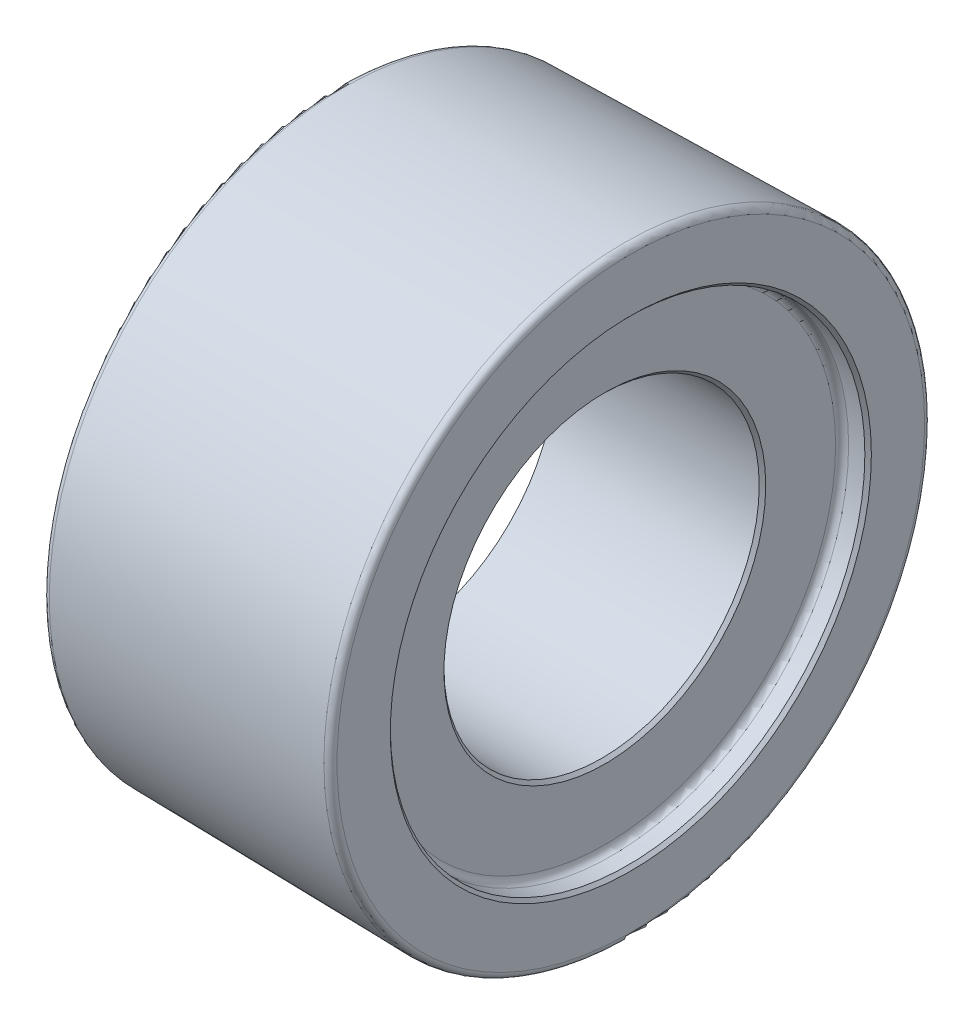
ISO-10303-21;
HEADER;
FILE_DESCRIPTION(('STEP AP214'),'2;1');
FILE_NAME('part.step','',(''),(''),'','','');
FILE_SCHEMA(('AUTOMOTIVE_DESIGN { 1 0 10303 214 1 1 1 1 }'));
ENDSEC;
DATA;
#1=APPLICATION_CONTEXT('core data for automotive mechanical design processes');
#2=APPLICATION_PROTOCOL_DEFINITION('international standard','automotive_design',2000,#1);
#3=PRODUCT_CONTEXT('',#1,'mechanical');
#4=PRODUCT('Part','Part','',(#3));
#5=PRODUCT_RELATED_PRODUCT_CATEGORY('part','',(#4));
#6=PRODUCT_DEFINITION_FORMATION('','',#4);
#7=PRODUCT_DEFINITION_CONTEXT('part definition',#1,'design');
#8=PRODUCT_DEFINITION('design','',#6,#7);
#9=PRODUCT_DEFINITION_SHAPE('','',#8);
#10=(LENGTH_UNIT() NAMED_UNIT(*) SI_UNIT(.MILLI.,.METRE.));
#11=(NAMED_UNIT(*) PLANE_ANGLE_UNIT() SI_UNIT($,.RADIAN.));
#12=(NAMED_UNIT(*) SI_UNIT($,.STERADIAN.) SOLID_ANGLE_UNIT());
#13=UNCERTAINTY_MEASURE_WITH_UNIT(LENGTH_MEASURE(1.E-05),#10,'distance_accuracy_value','');
#14=(GEOMETRIC_REPRESENTATION_CONTEXT(3) GLOBAL_UNCERTAINTY_ASSIGNED_CONTEXT((#13)) GLOBAL_UNIT_ASSIGNED_CONTEXT((#10,
#11,#12)) REPRESENTATION_CONTEXT('',''));
#15=CARTESIAN_POINT('',(0.,0.,0.));
#16=DIRECTION('',(0.,0.,1.));
#17=DIRECTION('',(1.,0.,0.));
#18=AXIS2_PLACEMENT_3D('',#15,#16,#17);
#19=CARTESIAN_POINT('',(9.17986928011499,0.,0.));
#20=DIRECTION('',(-1.,0.,0.));
#21=DIRECTION('',(0.,0.,1.));
#22=AXIS2_PLACEMENT_3D('',#19,#20,#21);
#23=CONICAL_SURFACE('',#22,24.25,1.0471975511966);
#24=CARTESIAN_POINT('',(0.,0.,0.));
#25=DIRECTION('',(-1.,0.,0.));
#26=DIRECTION('',(0.,0.,1.));
#27=AXIS2_PLACEMENT_3D('',#24,#25,#26);
#28=CIRCLE('',#27,40.15);
#29=CARTESIAN_POINT('',(0.,0.,40.15));
#30=VERTEX_POINT('',#29);
#31=EDGE_CURVE('E69',#30,#30,#28,.T.);
#32=ORIENTED_EDGE('',*,*,#31,.T.);
#33=EDGE_LOOP('',(#32));
#34=FACE_BOUND('',#33,.T.);
#35=CARTESIAN_POINT('',(9.17986928011499,0.,0.));
#36=DIRECTION('',(-1.,0.,0.));
#37=DIRECTION('',(0.,0.,1.));
#38=AXIS2_PLACEMENT_3D('',#35,#36,#37);
#39=CIRCLE('',#38,24.25);
#40=CARTESIAN_POINT('',(9.17986928011499,0.,24.25));
#41=VERTEX_POINT('',#40);
#42=EDGE_CURVE('E72',#41,#41,#39,.T.);
#43=ORIENTED_EDGE('',*,*,#42,.F.);
#44=EDGE_LOOP('',(#43));
#45=FACE_BOUND('',#44,.T.);
#46=ADVANCED_FACE('F31',(#34,#45),#23,.F.);
#47=CARTESIAN_POINT('',(0.,-40.15,0.));
#48=DIRECTION('',(-1.,0.,0.));
#49=DIRECTION('',(0.,0.,1.));
#50=AXIS2_PLACEMENT_3D('',#47,#48,#49);
#51=PLANE('',#50);
#52=CARTESIAN_POINT('',(0.,0.,0.));
#53=DIRECTION('',(-1.,0.,0.));
#54=DIRECTION('',(0.,0.,1.));
#55=AXIS2_PLACEMENT_3D('',#52,#53,#54);
#56=CIRCLE('',#55,44.4418248151148);
#57=CARTESIAN_POINT('',(0.,0.,44.4418248151148));
#58=VERTEX_POINT('',#57);
#59=EDGE_CURVE('E57',#58,#58,#56,.T.);
#60=ORIENTED_EDGE('',*,*,#59,.T.);
#61=EDGE_LOOP('',(#60));
#62=FACE_BOUND('',#61,.T.);
#63=ORIENTED_EDGE('',*,*,#31,.F.);
#64=EDGE_LOOP('',(#63));
#65=FACE_BOUND('',#64,.T.);
#66=ADVANCED_FACE('F79',(#62,#65),#51,.T.);
#67=CARTESIAN_POINT('',(0.,0.,0.));
#68=DIRECTION('',(1.,0.,0.));
#69=DIRECTION('',(0.,0.,-1.));
#70=AXIS2_PLACEMENT_3D('',#67,#68,#69);
#71=CONICAL_SURFACE('',#70,45.4245220782305,0.0174532925199362);
#72=CARTESIAN_POINT('',(43.9825475935627,0.,0.));
#73=DIRECTION('',(-1.,0.,0.));
#74=DIRECTION('',(0.,0.,1.));
#75=AXIS2_PLACEMENT_3D('',#72,#73,#74);
#76=CIRCLE('',#75,46.1922403021843);
#77=CARTESIAN_POINT('',(43.9825475935627,0.,46.1922403021843));
#78=VERTEX_POINT('',#77);
#79=EDGE_CURVE('E63',#78,#78,#76,.T.);
#80=ORIENTED_EDGE('',*,*,#79,.T.);
#81=EDGE_LOOP('',(#80));
#82=FACE_BOUND('',#81,.T.);
#83=CARTESIAN_POINT('',(0.982547593562533,0.,0.));
#84=DIRECTION('',(-1.,0.,0.));
#85=DIRECTION('',(0.,0.,1.));
#86=AXIS2_PLACEMENT_3D('',#83,#84,#85);
#87=CIRCLE('',#86,45.4416725102712);
#88=CARTESIAN_POINT('',(0.982547593562533,0.,45.4416725102712));
#89=VERTEX_POINT('',#88);
#90=EDGE_CURVE('E66',#89,#89,#87,.F.);
#91=ORIENTED_EDGE('',*,*,#90,.T.);
#92=EDGE_LOOP('',(#91));
#93=FACE_BOUND('',#92,.T.);
#94=ADVANCED_FACE('F85',(#82,#93),#71,.T.);
#95=CARTESIAN_POINT('',(45.,-46.21,0.));
#96=DIRECTION('',(1.,0.,0.));
#97=DIRECTION('',(0.,0.,-1.));
#98=AXIS2_PLACEMENT_3D('',#95,#96,#97);
#99=PLANE('',#98);
#100=CARTESIAN_POINT('',(45.,0.,0.));
#101=DIRECTION('',(1.,0.,0.));
#102=DIRECTION('',(0.,0.,-1.));
#103=AXIS2_PLACEMENT_3D('',#100,#101,#102);
#104=CIRCLE('',#103,37.);
#105=CARTESIAN_POINT('',(45.,0.,-37.));
#106=VERTEX_POINT('',#105);
#107=EDGE_CURVE('E46',#106,#106,#104,.F.);
#108=ORIENTED_EDGE('',*,*,#107,.T.);
#109=EDGE_LOOP('',(#108));
#110=FACE_BOUND('',#109,.T.);
#111=CARTESIAN_POINT('',(45.,0.,0.));
#112=DIRECTION('',(1.,0.,0.));
#113=DIRECTION('',(0.,0.,-1.));
#114=AXIS2_PLACEMENT_3D('',#111,#112,#113);
#115=CIRCLE('',#114,45.1923926070279);
#116=CARTESIAN_POINT('',(45.,0.,-45.1923926070279));
#117=VERTEX_POINT('',#116);
#118=EDGE_CURVE('E60',#117,#117,#115,.T.);
#119=ORIENTED_EDGE('',*,*,#118,.T.);
#120=EDGE_LOOP('',(#119));
#121=FACE_BOUND('',#120,.T.);
#122=ADVANCED_FACE('F112',(#110,#121),#99,.T.);
#123=CARTESIAN_POINT('',(0.,0.,0.));
#124=DIRECTION('',(-1.,0.,0.));
#125=DIRECTION('',(0.,0.,1.));
#126=AXIS2_PLACEMENT_3D('',#123,#124,#125);
#127=CYLINDRICAL_SURFACE('',#126,36.5);
#128=CARTESIAN_POINT('',(42.,0.,0.));
#129=DIRECTION('',(1.,0.,0.));
#130=DIRECTION('',(0.,0.,-1.));
#131=AXIS2_PLACEMENT_3D('',#128,#129,#130);
#132=CIRCLE('',#131,36.5);
#133=CARTESIAN_POINT('',(42.,0.,-36.5));
#134=VERTEX_POINT('',#133);
#135=EDGE_CURVE('E38',#134,#134,#132,.F.);
#136=ORIENTED_EDGE('',*,*,#135,.T.);
#137=EDGE_LOOP('',(#136));
#138=FACE_BOUND('',#137,.T.);
#139=CARTESIAN_POINT('',(44.5,0.,0.));
#140=DIRECTION('',(1.,0.,0.));
#141=DIRECTION('',(0.,0.,-1.));
#142=AXIS2_PLACEMENT_3D('',#139,#140,#141);
#143=CIRCLE('',#142,36.5);
#144=CARTESIAN_POINT('',(44.5,0.,-36.5));
#145=VERTEX_POINT('',#144);
#146=EDGE_CURVE('E42',#145,#145,#143,.T.);
#147=ORIENTED_EDGE('',*,*,#146,.T.);
#148=EDGE_LOOP('',(#147));
#149=FACE_BOUND('',#148,.T.);
#150=ADVANCED_FACE('F115',(#138,#149),#127,.F.);
#151=CARTESIAN_POINT('',(41.,-36.5,0.));
#152=DIRECTION('',(1.,0.,0.));
#153=DIRECTION('',(0.,0.,-1.));
#154=AXIS2_PLACEMENT_3D('',#151,#152,#153);
#155=PLANE('',#154);
#156=CARTESIAN_POINT('',(41.,0.,0.));
#157=DIRECTION('',(1.,0.,0.));
#158=DIRECTION('',(0.,0.,-1.));
#159=AXIS2_PLACEMENT_3D('',#156,#157,#158);
#160=CIRCLE('',#159,35.5);
#161=CARTESIAN_POINT('',(41.,0.,-35.5));
#162=VERTEX_POINT('',#161);
#163=EDGE_CURVE('E10',#162,#162,#160,.T.);
#164=ORIENTED_EDGE('',*,*,#163,.T.);
#165=EDGE_LOOP('',(#164));
#166=FACE_BOUND('',#165,.T.);
#167=CARTESIAN_POINT('',(41.,0.,0.));
#168=DIRECTION('',(1.,0.,0.));
#169=DIRECTION('',(0.,0.,-1.));
#170=AXIS2_PLACEMENT_3D('',#167,#168,#169);
#171=CIRCLE('',#170,24.75);
#172=CARTESIAN_POINT('',(41.,0.,-24.75));
#173=VERTEX_POINT('',#172);
#174=EDGE_CURVE('E54',#173,#173,#171,.F.);
#175=ORIENTED_EDGE('',*,*,#174,.T.);
#176=EDGE_LOOP('',(#175));
#177=FACE_BOUND('',#176,.T.);
#178=ADVANCED_FACE('F133',(#166,#177),#155,.T.);
#179=CARTESIAN_POINT('',(0.,0.,0.));
#180=DIRECTION('',(-1.,0.,0.));
#181=DIRECTION('',(0.,0.,1.));
#182=AXIS2_PLACEMENT_3D('',#179,#180,#181);
#183=CYLINDRICAL_SURFACE('',#182,24.25);
#184=CARTESIAN_POINT('',(40.5,0.,0.));
#185=DIRECTION('',(1.,0.,0.));
#186=DIRECTION('',(0.,0.,-1.));
#187=AXIS2_PLACEMENT_3D('',#184,#185,#186);
#188=CIRCLE('',#187,24.25);
#189=CARTESIAN_POINT('',(40.5,0.,-24.25));
#190=VERTEX_POINT('',#189);
#191=EDGE_CURVE('E51',#190,#190,#188,.T.);
#192=ORIENTED_EDGE('',*,*,#191,.T.);
#193=EDGE_LOOP('',(#192));
#194=FACE_BOUND('',#193,.T.);
#195=ORIENTED_EDGE('',*,*,#42,.T.);
#196=EDGE_LOOP('',(#195));
#197=FACE_BOUND('',#196,.T.);
#198=ADVANCED_FACE('F76',(#194,#197),#183,.F.);
#199=CARTESIAN_POINT('',(44.,0.,0.));
#200=DIRECTION('',(1.,0.,0.));
#201=DIRECTION('',(0.,0.,-1.));
#202=AXIS2_PLACEMENT_3D('',#199,#200,#201);
#203=TOROIDAL_SURFACE('',#202,45.1923926070279,1.);
#204=ORIENTED_EDGE('',*,*,#118,.F.);
#205=EDGE_LOOP('',(#204));
#206=FACE_BOUND('',#205,.T.);
#207=ORIENTED_EDGE('',*,*,#79,.F.);
#208=EDGE_LOOP('',(#207));
#209=FACE_BOUND('',#208,.T.);
#210=ADVANCED_FACE('F90',(#206,#209),#203,.T.);
#211=CARTESIAN_POINT('',(1.,0.,0.));
#212=DIRECTION('',(-1.,0.,0.));
#213=DIRECTION('',(0.,0.,1.));
#214=AXIS2_PLACEMENT_3D('',#211,#212,#213);
#215=TOROIDAL_SURFACE('',#214,44.4418248151148,1.);
#216=ORIENTED_EDGE('',*,*,#90,.F.);
#217=EDGE_LOOP('',(#216));
#218=FACE_BOUND('',#217,.T.);
#219=ORIENTED_EDGE('',*,*,#59,.F.);
#220=EDGE_LOOP('',(#219));
#221=FACE_BOUND('',#220,.T.);
#222=ADVANCED_FACE('F93',(#218,#221),#215,.T.);
#223=CARTESIAN_POINT('',(41.,0.,0.));
#224=DIRECTION('',(1.,0.,0.));
#225=DIRECTION('',(0.,0.,-1.));
#226=AXIS2_PLACEMENT_3D('',#223,#224,#225);
#227=CONICAL_SURFACE('',#226,24.75,0.785398163397455);
#228=ORIENTED_EDGE('',*,*,#191,.F.);
#229=EDGE_LOOP('',(#228));
#230=FACE_BOUND('',#229,.T.);
#231=ORIENTED_EDGE('',*,*,#174,.F.);
#232=EDGE_LOOP('',(#231));
#233=FACE_BOUND('',#232,.T.);
#234=ADVANCED_FACE('F97',(#230,#233),#227,.F.);
#235=CARTESIAN_POINT('',(45.,0.,0.));
#236=DIRECTION('',(1.,0.,0.));
#237=DIRECTION('',(0.,0.,-1.));
#238=AXIS2_PLACEMENT_3D('',#235,#236,#237);
#239=CONICAL_SURFACE('',#238,37.,0.785398163397455);
#240=ORIENTED_EDGE('',*,*,#146,.F.);
#241=EDGE_LOOP('',(#240));
#242=FACE_BOUND('',#241,.T.);
#243=ORIENTED_EDGE('',*,*,#107,.F.);
#244=EDGE_LOOP('',(#243));
#245=FACE_BOUND('',#244,.T.);
#246=ADVANCED_FACE('F100',(#242,#245),#239,.F.);
#247=CARTESIAN_POINT('',(42.,0.,0.));
#248=DIRECTION('',(1.,0.,0.));
#249=DIRECTION('',(0.,0.,-1.));
#250=AXIS2_PLACEMENT_3D('',#247,#248,#249);
#251=TOROIDAL_SURFACE('',#250,35.5,1.);
#252=ORIENTED_EDGE('',*,*,#163,.F.);
#253=EDGE_LOOP('',(#252));
#254=FACE_BOUND('',#253,.T.);
#255=ORIENTED_EDGE('',*,*,#135,.F.);
#256=EDGE_LOOP('',(#255));
#257=FACE_BOUND('',#256,.T.);
#258=ADVANCED_FACE('F33',(#254,#257),#251,.F.);
#259=CLOSED_SHELL('',(#46,#66,#94,#122,#150,#178,#198,#210,#222,#234,#246,#258));
#260=MANIFOLD_SOLID_BREP('B2',#259);
#261=ADVANCED_BREP_SHAPE_REPRESENTATION('',(#18,#260),#14);
#262=SHAPE_DEFINITION_REPRESENTATION(#9,#261);
ENDSEC;
END-ISO-10303-21;
